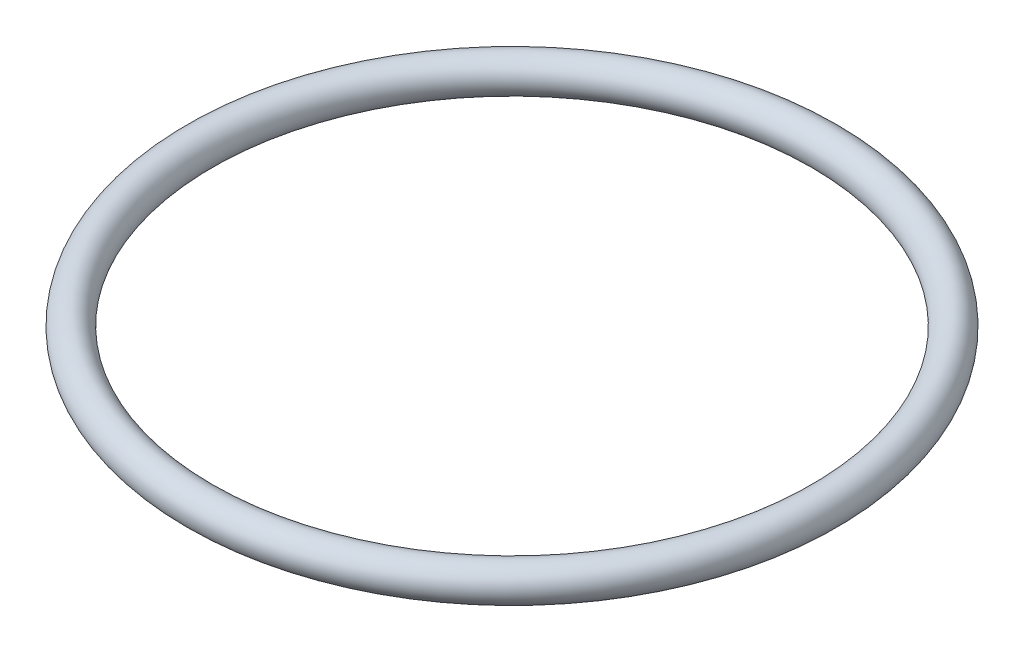
ISO-10303-21;
HEADER;
FILE_DESCRIPTION(('STEP AP214'),'2;1');
FILE_NAME('part.step','',(''),(''),'','','');
FILE_SCHEMA(('AUTOMOTIVE_DESIGN { 1 0 10303 214 1 1 1 1 }'));
ENDSEC;
DATA;
#1=APPLICATION_CONTEXT('core data for automotive mechanical design processes');
#2=APPLICATION_PROTOCOL_DEFINITION('international standard','automotive_design',2000,#1);
#3=PRODUCT_CONTEXT('',#1,'mechanical');
#4=PRODUCT('Part','Part','',(#3));
#5=PRODUCT_RELATED_PRODUCT_CATEGORY('part','',(#4));
#6=PRODUCT_DEFINITION_FORMATION('','',#4);
#7=PRODUCT_DEFINITION_CONTEXT('part definition',#1,'design');
#8=PRODUCT_DEFINITION('design','',#6,#7);
#9=PRODUCT_DEFINITION_SHAPE('','',#8);
#10=(LENGTH_UNIT() NAMED_UNIT(*) SI_UNIT(.MILLI.,.METRE.));
#11=(NAMED_UNIT(*) PLANE_ANGLE_UNIT() SI_UNIT($,.RADIAN.));
#12=(NAMED_UNIT(*) SI_UNIT($,.STERADIAN.) SOLID_ANGLE_UNIT());
#13=UNCERTAINTY_MEASURE_WITH_UNIT(LENGTH_MEASURE(1.E-05),#10,'distance_accuracy_value','');
#14=(GEOMETRIC_REPRESENTATION_CONTEXT(3) GLOBAL_UNCERTAINTY_ASSIGNED_CONTEXT((#13)) GLOBAL_UNIT_ASSIGNED_CONTEXT((#10,
#11,#12)) REPRESENTATION_CONTEXT('',''));
#15=CARTESIAN_POINT('',(0.,0.,0.));
#16=DIRECTION('',(0.,0.,1.));
#17=DIRECTION('',(1.,0.,0.));
#18=AXIS2_PLACEMENT_3D('',#15,#16,#17);
#19=CARTESIAN_POINT('',(0.,0.,0.));
#20=DIRECTION('',(0.,-1.,0.));
#21=DIRECTION('',(0.,0.,-1.));
#22=AXIS2_PLACEMENT_3D('',#19,#20,#21);
#23=TOROIDAL_SURFACE('',#22,35.5,2.);
#24=CARTESIAN_POINT('',(0.,0.,-37.5));
#25=VERTEX_POINT('',#24);
#26=VERTEX_LOOP('',#25);
#27=FACE_BOUND('',#26,.T.);
#28=ADVANCED_FACE('F35',(#27),#23,.T.);
#29=CLOSED_SHELL('',(#28));
#30=MANIFOLD_SOLID_BREP('B2',#29);
#31=ADVANCED_BREP_SHAPE_REPRESENTATION('',(#18,#30),#14);
#32=SHAPE_DEFINITION_REPRESENTATION(#9,#31);
ENDSEC;
END-ISO-10303-21;
